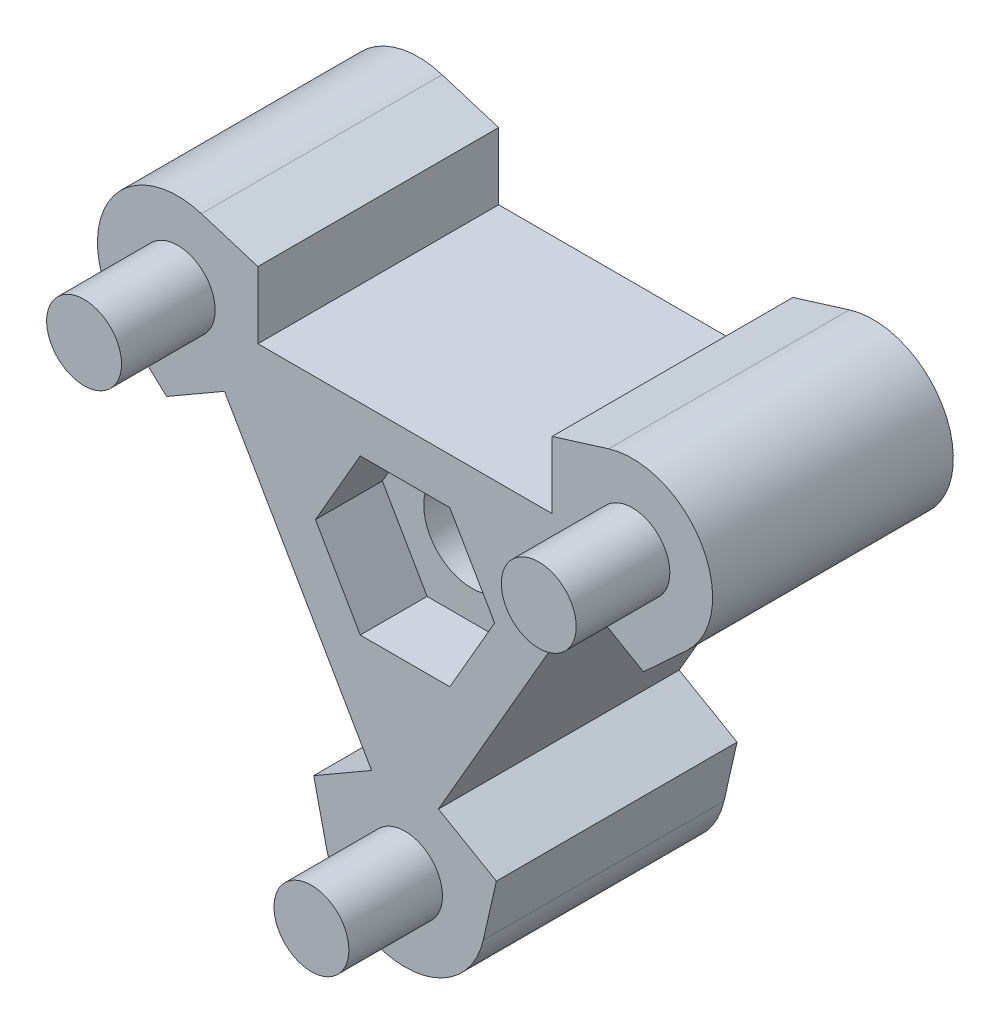
ISO-10303-21;
HEADER;
FILE_DESCRIPTION(('STEP AP214'),'2;1');
FILE_NAME('part.step','',(''),(''),'','','');
FILE_SCHEMA(('AUTOMOTIVE_DESIGN { 1 0 10303 214 1 1 1 1 }'));
ENDSEC;
DATA;
#1=APPLICATION_CONTEXT('core data for automotive mechanical design processes');
#2=APPLICATION_PROTOCOL_DEFINITION('international standard','automotive_design',2000,#1);
#3=PRODUCT_CONTEXT('',#1,'mechanical');
#4=PRODUCT('Part','Part','',(#3));
#5=PRODUCT_RELATED_PRODUCT_CATEGORY('part','',(#4));
#6=PRODUCT_DEFINITION_FORMATION('','',#4);
#7=PRODUCT_DEFINITION_CONTEXT('part definition',#1,'design');
#8=PRODUCT_DEFINITION('design','',#6,#7);
#9=PRODUCT_DEFINITION_SHAPE('','',#8);
#10=(LENGTH_UNIT() NAMED_UNIT(*) SI_UNIT(.MILLI.,.METRE.));
#11=(NAMED_UNIT(*) PLANE_ANGLE_UNIT() SI_UNIT($,.RADIAN.));
#12=(NAMED_UNIT(*) SI_UNIT($,.STERADIAN.) SOLID_ANGLE_UNIT());
#13=UNCERTAINTY_MEASURE_WITH_UNIT(LENGTH_MEASURE(1.E-05),#10,'distance_accuracy_value','');
#14=(GEOMETRIC_REPRESENTATION_CONTEXT(3) GLOBAL_UNCERTAINTY_ASSIGNED_CONTEXT((#13)) GLOBAL_UNIT_ASSIGNED_CONTEXT((#10,
#11,#12)) REPRESENTATION_CONTEXT('',''));
#15=CARTESIAN_POINT('',(0.,0.,0.));
#16=DIRECTION('',(0.,0.,1.));
#17=DIRECTION('',(1.,0.,0.));
#18=AXIS2_PLACEMENT_3D('',#15,#16,#17);
#19=CARTESIAN_POINT('',(2.74999999999996,4.76313972081436,4.));
#20=DIRECTION('',(0.499999999999998,0.86602540378444,0.));
#21=DIRECTION('',(-0.86602540378444,0.499999999999998,0.));
#22=AXIS2_PLACEMENT_3D('',#19,#20,#21);
#23=PLANE('',#22);
#24=DIRECTION('',(0.,0.,-1.));
#25=VECTOR('',#24,1.);
#26=CARTESIAN_POINT('',(6.74999999999994,2.45373864405588,4.));
#27=LINE('',#26,#25);
#28=CARTESIAN_POINT('',(6.74999999999994,2.45373864405588,4.));
#29=VERTEX_POINT('',#28);
#30=CARTESIAN_POINT('',(6.74999999999994,2.45373864405588,-5.));
#31=VERTEX_POINT('',#30);
#32=EDGE_CURVE('E218',#29,#31,#27,.T.);
#33=ORIENTED_EDGE('',*,*,#32,.T.);
#34=DIRECTION('',(-0.86602540378444,0.499999999999998,0.));
#35=VECTOR('',#34,1.);
#36=CARTESIAN_POINT('',(8.91506350946104,1.20373864405588,-5.));
#37=LINE('',#36,#35);
#38=CARTESIAN_POINT('',(8.91506350946104,1.20373864405588,-5.));
#39=VERTEX_POINT('',#38);
#40=EDGE_CURVE('E217',#39,#31,#37,.T.);
#41=ORIENTED_EDGE('',*,*,#40,.F.);
#42=DIRECTION('',(0.,0.,-1.));
#43=VECTOR('',#42,1.);
#44=CARTESIAN_POINT('',(8.91506350946104,1.20373864405588,4.));
#45=LINE('',#44,#43);
#46=CARTESIAN_POINT('',(8.91506350946104,1.20373864405588,4.));
#47=VERTEX_POINT('',#46);
#48=EDGE_CURVE('E11',#47,#39,#45,.T.);
#49=ORIENTED_EDGE('',*,*,#48,.F.);
#50=DIRECTION('',(0.86602540378444,-0.499999999999998,0.));
#51=VECTOR('',#50,1.);
#52=CARTESIAN_POINT('',(2.74999999999996,4.76313972081436,4.));
#53=LINE('',#52,#51);
#54=EDGE_CURVE('E382',#29,#47,#53,.T.);
#55=ORIENTED_EDGE('',*,*,#54,.F.);
#56=EDGE_LOOP('',(#33,#41,#49,#55));
#57=FACE_BOUND('',#56,.T.);
#58=ADVANCED_FACE('F45',(#57),#23,.F.);
#59=CARTESIAN_POINT('',(3.51368872105919,-3.79597064243409,4.));
#60=DIRECTION('',(-0.679293639164496,0.733866576286627,0.));
#61=DIRECTION('',(-0.733866576286627,-0.679293639164496,0.));
#62=AXIS2_PLACEMENT_3D('',#59,#60,#61);
#63=PLANE('',#62);
#64=ORIENTED_EDGE('',*,*,#48,.T.);
#65=DIRECTION('',(-0.733866576286624,-0.679293639164499,0.));
#66=VECTOR('',#65,1.);
#67=CARTESIAN_POINT('',(10.5378809174934,2.70587755925193,-5.));
#68=LINE('',#67,#66);
#69=CARTESIAN_POINT('',(10.5378809174934,2.70587755925193,-5.));
#70=VERTEX_POINT('',#69);
#71=EDGE_CURVE('E212',#70,#39,#68,.T.);
#72=ORIENTED_EDGE('',*,*,#71,.F.);
#73=DIRECTION('',(0.,0.,-1.));
#74=VECTOR('',#73,1.);
#75=CARTESIAN_POINT('',(10.5378809174934,2.70587755925192,4.));
#76=LINE('',#75,#74);
#77=CARTESIAN_POINT('',(10.5378809174934,2.70587755925192,4.));
#78=VERTEX_POINT('',#77);
#79=EDGE_CURVE('E54',#78,#70,#76,.T.);
#80=ORIENTED_EDGE('',*,*,#79,.F.);
#81=DIRECTION('',(0.733866576286627,0.679293639164496,0.));
#82=VECTOR('',#81,1.);
#83=CARTESIAN_POINT('',(3.51368872105919,-3.79597064243409,4.));
#84=LINE('',#83,#82);
#85=EDGE_CURVE('E213',#47,#78,#84,.T.);
#86=ORIENTED_EDGE('',*,*,#85,.F.);
#87=EDGE_LOOP('',(#64,#72,#80,#86));
#88=FACE_BOUND('',#87,.T.);
#89=ADVANCED_FACE('F209',(#88),#63,.F.);
#90=CARTESIAN_POINT('',(8.5,4.90747728811182,4.));
#91=DIRECTION('',(0.,0.,-1.));
#92=DIRECTION('',(-1.,0.,0.));
#93=AXIS2_PLACEMENT_3D('',#90,#91,#92);
#94=CYLINDRICAL_SURFACE('',#93,2.99999999999997);
#95=ORIENTED_EDGE('',*,*,#79,.T.);
#96=CARTESIAN_POINT('',(8.5,4.90747728811182,-5.));
#97=DIRECTION('',(0.,0.,-1.));
#98=DIRECTION('',(-1.,0.,0.));
#99=AXIS2_PLACEMENT_3D('',#96,#97,#98);
#100=CIRCLE('',#99,2.99999999999996);
#101=CARTESIAN_POINT('',(7.61229916458921,7.77313379697863,-5.));
#102=VERTEX_POINT('',#101);
#103=EDGE_CURVE('E230',#102,#70,#100,.T.);
#104=ORIENTED_EDGE('',*,*,#103,.F.);
#105=DIRECTION('',(0.,0.,-1.));
#106=VECTOR('',#105,1.);
#107=CARTESIAN_POINT('',(7.61229916458921,7.77313379697863,4.));
#108=LINE('',#107,#106);
#109=CARTESIAN_POINT('',(7.61229916458921,7.77313379697863,4.));
#110=VERTEX_POINT('',#109);
#111=EDGE_CURVE('E487',#110,#102,#108,.T.);
#112=ORIENTED_EDGE('',*,*,#111,.F.);
#113=CARTESIAN_POINT('',(8.5,4.90747728811182,4.));
#114=DIRECTION('',(0.,0.,1.));
#115=DIRECTION('',(1.,0.,0.));
#116=AXIS2_PLACEMENT_3D('',#113,#114,#115);
#117=CIRCLE('',#116,2.99999999999997);
#118=EDGE_CURVE('E390',#78,#110,#117,.T.);
#119=ORIENTED_EDGE('',*,*,#118,.F.);
#120=EDGE_LOOP('',(#95,#104,#112,#119));
#121=FACE_BOUND('',#120,.T.);
#122=ADVANCED_FACE('F493',(#121),#94,.T.);
#123=CARTESIAN_POINT('',(-1.53056264783827,4.9409290146451,4.));
#124=DIRECTION('',(-0.295900278470285,0.955218836288946,0.));
#125=DIRECTION('',(-0.955218836288946,-0.295900278470285,0.));
#126=AXIS2_PLACEMENT_3D('',#123,#124,#125);
#127=PLANE('',#126);
#128=ORIENTED_EDGE('',*,*,#111,.T.);
#129=DIRECTION('',(0.955218836288946,0.295900278470285,0.));
#130=VECTOR('',#129,1.);
#131=CARTESIAN_POINT('',(5.50000000000006,7.11880215351697,-5.));
#132=LINE('',#131,#130);
#133=CARTESIAN_POINT('',(5.50000000000006,7.11880215351697,-5.));
#134=VERTEX_POINT('',#133);
#135=EDGE_CURVE('E292',#134,#102,#132,.T.);
#136=ORIENTED_EDGE('',*,*,#135,.F.);
#137=DIRECTION('',(0.,0.,-1.));
#138=VECTOR('',#137,1.);
#139=CARTESIAN_POINT('',(5.50000000000006,7.11880215351697,4.));
#140=LINE('',#139,#138);
#141=CARTESIAN_POINT('',(5.50000000000006,7.11880215351697,4.));
#142=VERTEX_POINT('',#141);
#143=EDGE_CURVE('E484',#142,#134,#140,.T.);
#144=ORIENTED_EDGE('',*,*,#143,.F.);
#145=DIRECTION('',(0.955218836288946,0.295900278470285,0.));
#146=VECTOR('',#145,1.);
#147=CARTESIAN_POINT('',(-1.53056264783827,4.9409290146451,4.));
#148=LINE('',#147,#146);
#149=EDGE_CURVE('E393',#142,#110,#148,.T.);
#150=ORIENTED_EDGE('',*,*,#149,.T.);
#151=EDGE_LOOP('',(#128,#136,#144,#150));
#152=FACE_BOUND('',#151,.T.);
#153=ADVANCED_FACE('F572',(#152),#127,.T.);
#154=CARTESIAN_POINT('',(5.50000000000006,0.,4.));
#155=DIRECTION('',(-1.,0.,0.));
#156=DIRECTION('',(0.,-1.,0.));
#157=AXIS2_PLACEMENT_3D('',#154,#155,#156);
#158=PLANE('',#157);
#159=ORIENTED_EDGE('',*,*,#143,.T.);
#160=DIRECTION('',(0.,1.,0.));
#161=VECTOR('',#160,1.);
#162=CARTESIAN_POINT('',(5.50000000000006,4.61880215351697,-5.));
#163=LINE('',#162,#161);
#164=CARTESIAN_POINT('',(5.50000000000006,4.61880215351697,-5.));
#165=VERTEX_POINT('',#164);
#166=EDGE_CURVE('E288',#165,#134,#163,.T.);
#167=ORIENTED_EDGE('',*,*,#166,.F.);
#168=DIRECTION('',(0.,0.,-1.));
#169=VECTOR('',#168,1.);
#170=CARTESIAN_POINT('',(5.50000000000006,4.61880215351697,4.));
#171=LINE('',#170,#169);
#172=CARTESIAN_POINT('',(5.50000000000006,4.61880215351697,4.));
#173=VERTEX_POINT('',#172);
#174=EDGE_CURVE('E481',#173,#165,#171,.T.);
#175=ORIENTED_EDGE('',*,*,#174,.F.);
#176=DIRECTION('',(0.,1.,0.));
#177=VECTOR('',#176,1.);
#178=CARTESIAN_POINT('',(5.50000000000006,0.,4.));
#179=LINE('',#178,#177);
#180=EDGE_CURVE('E397',#173,#142,#179,.T.);
#181=ORIENTED_EDGE('',*,*,#180,.T.);
#182=EDGE_LOOP('',(#159,#167,#175,#181));
#183=FACE_BOUND('',#182,.T.);
#184=ADVANCED_FACE('F500',(#183),#158,.T.);
#185=CARTESIAN_POINT('',(0.,4.61880215351697,4.));
#186=DIRECTION('',(0.,-1.,0.));
#187=DIRECTION('',(1.,0.,0.));
#188=AXIS2_PLACEMENT_3D('',#185,#186,#187);
#189=PLANE('',#188);
#190=ORIENTED_EDGE('',*,*,#174,.T.);
#191=DIRECTION('',(1.,0.,0.));
#192=VECTOR('',#191,1.);
#193=CARTESIAN_POINT('',(-5.49999999999994,4.61880215351697,-5.));
#194=LINE('',#193,#192);
#195=CARTESIAN_POINT('',(-5.49999999999994,4.61880215351697,-5.));
#196=VERTEX_POINT('',#195);
#197=EDGE_CURVE('E284',#196,#165,#194,.T.);
#198=ORIENTED_EDGE('',*,*,#197,.F.);
#199=DIRECTION('',(0.,0.,-1.));
#200=VECTOR('',#199,1.);
#201=CARTESIAN_POINT('',(-5.49999999999994,4.61880215351697,4.));
#202=LINE('',#201,#200);
#203=CARTESIAN_POINT('',(-5.49999999999994,4.61880215351697,4.));
#204=VERTEX_POINT('',#203);
#205=EDGE_CURVE('E478',#204,#196,#202,.T.);
#206=ORIENTED_EDGE('',*,*,#205,.F.);
#207=DIRECTION('',(-1.,0.,0.));
#208=VECTOR('',#207,1.);
#209=CARTESIAN_POINT('',(0.,4.61880215351697,4.));
#210=LINE('',#209,#208);
#211=EDGE_CURVE('E401',#173,#204,#210,.T.);
#212=ORIENTED_EDGE('',*,*,#211,.F.);
#213=EDGE_LOOP('',(#190,#198,#206,#212));
#214=FACE_BOUND('',#213,.T.);
#215=ADVANCED_FACE('F506',(#214),#189,.F.);
#216=CARTESIAN_POINT('',(-5.49999999999993,0.,4.));
#217=DIRECTION('',(-1.,0.,0.));
#218=DIRECTION('',(0.,-1.,0.));
#219=AXIS2_PLACEMENT_3D('',#216,#217,#218);
#220=PLANE('',#219);
#221=ORIENTED_EDGE('',*,*,#205,.T.);
#222=DIRECTION('',(0.,-1.,0.));
#223=VECTOR('',#222,1.);
#224=CARTESIAN_POINT('',(-5.49999999999995,7.11880215351697,-5.));
#225=LINE('',#224,#223);
#226=CARTESIAN_POINT('',(-5.49999999999995,7.11880215351697,-5.));
#227=VERTEX_POINT('',#226);
#228=EDGE_CURVE('E280',#227,#196,#225,.T.);
#229=ORIENTED_EDGE('',*,*,#228,.F.);
#230=DIRECTION('',(0.,0.,-1.));
#231=VECTOR('',#230,1.);
#232=CARTESIAN_POINT('',(-5.49999999999995,7.11880215351697,4.));
#233=LINE('',#232,#231);
#234=CARTESIAN_POINT('',(-5.49999999999995,7.11880215351697,4.));
#235=VERTEX_POINT('',#234);
#236=EDGE_CURVE('E475',#235,#227,#233,.T.);
#237=ORIENTED_EDGE('',*,*,#236,.F.);
#238=DIRECTION('',(0.,1.,0.));
#239=VECTOR('',#238,1.);
#240=CARTESIAN_POINT('',(-5.49999999999993,0.,4.));
#241=LINE('',#240,#239);
#242=EDGE_CURVE('E404',#204,#235,#241,.T.);
#243=ORIENTED_EDGE('',*,*,#242,.F.);
#244=EDGE_LOOP('',(#221,#229,#237,#243));
#245=FACE_BOUND('',#244,.T.);
#246=ADVANCED_FACE('F513',(#245),#220,.F.);
#247=CARTESIAN_POINT('',(1.53056264783827,4.94092901464514,4.));
#248=DIRECTION('',(-0.295900278470283,-0.955218836288946,0.));
#249=DIRECTION('',(0.955218836288946,-0.295900278470283,0.));
#250=AXIS2_PLACEMENT_3D('',#247,#248,#249);
#251=PLANE('',#250);
#252=ORIENTED_EDGE('',*,*,#236,.T.);
#253=DIRECTION('',(0.955218836288954,-0.29590027847026,0.));
#254=VECTOR('',#253,1.);
#255=CARTESIAN_POINT('',(-7.61229916458913,7.77313379697858,-5.));
#256=LINE('',#255,#254);
#257=CARTESIAN_POINT('',(-7.61229916458913,7.77313379697855,-5.));
#258=VERTEX_POINT('',#257);
#259=EDGE_CURVE('E276',#258,#227,#256,.T.);
#260=ORIENTED_EDGE('',*,*,#259,.F.);
#261=DIRECTION('',(0.,0.,-1.));
#262=VECTOR('',#261,1.);
#263=CARTESIAN_POINT('',(-7.61229916458911,7.77313379697863,4.));
#264=LINE('',#263,#262);
#265=CARTESIAN_POINT('',(-7.61229916458911,7.77313379697863,4.));
#266=VERTEX_POINT('',#265);
#267=EDGE_CURVE('E472',#266,#258,#264,.T.);
#268=ORIENTED_EDGE('',*,*,#267,.F.);
#269=DIRECTION('',(-0.955218836288946,0.295900278470283,0.));
#270=VECTOR('',#269,1.);
#271=CARTESIAN_POINT('',(1.53056264783827,4.94092901464514,4.));
#272=LINE('',#271,#270);
#273=EDGE_CURVE('E407',#235,#266,#272,.T.);
#274=ORIENTED_EDGE('',*,*,#273,.F.);
#275=EDGE_LOOP('',(#252,#260,#268,#274));
#276=FACE_BOUND('',#275,.T.);
#277=ADVANCED_FACE('F516',(#276),#251,.F.);
#278=CARTESIAN_POINT('',(-8.50000000000001,4.90747728811182,4.));
#279=DIRECTION('',(0.,0.,-1.));
#280=DIRECTION('',(-1.,0.,0.));
#281=AXIS2_PLACEMENT_3D('',#278,#279,#280);
#282=CYLINDRICAL_SURFACE('',#281,2.99999999999993);
#283=ORIENTED_EDGE('',*,*,#267,.T.);
#284=CARTESIAN_POINT('',(-8.50000000000001,4.90747728811182,-5.));
#285=DIRECTION('',(0.,0.,-1.));
#286=DIRECTION('',(-1.,0.,0.));
#287=AXIS2_PLACEMENT_3D('',#284,#285,#286);
#288=CIRCLE('',#287,2.99999999999991);
#289=CARTESIAN_POINT('',(-10.5378809174935,2.7058775592521,-5.));
#290=VERTEX_POINT('',#289);
#291=EDGE_CURVE('E272',#290,#258,#288,.T.);
#292=ORIENTED_EDGE('',*,*,#291,.F.);
#293=DIRECTION('',(0.,0.,-1.));
#294=VECTOR('',#293,1.);
#295=CARTESIAN_POINT('',(-10.5378809174935,2.7058775592521,4.));
#296=LINE('',#295,#294);
#297=CARTESIAN_POINT('',(-10.5378809174935,2.7058775592521,4.));
#298=VERTEX_POINT('',#297);
#299=EDGE_CURVE('E469',#298,#290,#296,.T.);
#300=ORIENTED_EDGE('',*,*,#299,.F.);
#301=CARTESIAN_POINT('',(-8.50000000000001,4.90747728811182,4.));
#302=DIRECTION('',(0.,0.,1.));
#303=DIRECTION('',(1.,0.,0.));
#304=AXIS2_PLACEMENT_3D('',#301,#302,#303);
#305=CIRCLE('',#304,2.99999999999993);
#306=EDGE_CURVE('E410',#266,#298,#305,.T.);
#307=ORIENTED_EDGE('',*,*,#306,.F.);
#308=EDGE_LOOP('',(#283,#292,#300,#307));
#309=FACE_BOUND('',#308,.T.);
#310=ADVANCED_FACE('F521',(#309),#282,.T.);
#311=CARTESIAN_POINT('',(-3.5136887210591,-3.79597064243401,4.));
#312=DIRECTION('',(-0.679293639164494,-0.733866576286628,0.));
#313=DIRECTION('',(0.733866576286628,-0.679293639164494,0.));
#314=AXIS2_PLACEMENT_3D('',#311,#312,#313);
#315=PLANE('',#314);
#316=ORIENTED_EDGE('',*,*,#299,.T.);
#317=DIRECTION('',(-0.733866576286629,0.679293639164494,0.));
#318=VECTOR('',#317,1.);
#319=CARTESIAN_POINT('',(-8.9150635094611,1.20373864405608,-5.));
#320=LINE('',#319,#318);
#321=CARTESIAN_POINT('',(-8.9150635094611,1.20373864405608,-5.));
#322=VERTEX_POINT('',#321);
#323=EDGE_CURVE('E268',#322,#290,#320,.T.);
#324=ORIENTED_EDGE('',*,*,#323,.F.);
#325=DIRECTION('',(0.,0.,-1.));
#326=VECTOR('',#325,1.);
#327=CARTESIAN_POINT('',(-8.9150635094611,1.20373864405608,4.));
#328=LINE('',#327,#326);
#329=CARTESIAN_POINT('',(-8.9150635094611,1.20373864405608,4.));
#330=VERTEX_POINT('',#329);
#331=EDGE_CURVE('E466',#330,#322,#328,.T.);
#332=ORIENTED_EDGE('',*,*,#331,.F.);
#333=DIRECTION('',(-0.733866576286628,0.679293639164494,0.));
#334=VECTOR('',#333,1.);
#335=CARTESIAN_POINT('',(-3.5136887210591,-3.79597064243401,4.));
#336=LINE('',#335,#334);
#337=EDGE_CURVE('E413',#330,#298,#336,.T.);
#338=ORIENTED_EDGE('',*,*,#337,.T.);
#339=EDGE_LOOP('',(#316,#324,#332,#338));
#340=FACE_BOUND('',#339,.T.);
#341=ADVANCED_FACE('F587',(#340),#315,.T.);
#342=CARTESIAN_POINT('',(-2.75000000000007,4.76313972081454,4.));
#343=DIRECTION('',(0.499999999999999,-0.866025403784439,0.));
#344=DIRECTION('',(0.866025403784439,0.5,0.));
#345=AXIS2_PLACEMENT_3D('',#342,#343,#344);
#346=PLANE('',#345);
#347=ORIENTED_EDGE('',*,*,#331,.T.);
#348=DIRECTION('',(-0.866025403784439,-0.499999999999999,0.));
#349=VECTOR('',#348,1.);
#350=CARTESIAN_POINT('',(-6.75,2.45373864405608,-5.));
#351=LINE('',#350,#349);
#352=CARTESIAN_POINT('',(-6.75,2.45373864405608,-5.));
#353=VERTEX_POINT('',#352);
#354=EDGE_CURVE('E264',#353,#322,#351,.T.);
#355=ORIENTED_EDGE('',*,*,#354,.F.);
#356=DIRECTION('',(0.,0.,-1.));
#357=VECTOR('',#356,1.);
#358=CARTESIAN_POINT('',(-6.75,2.45373864405608,4.));
#359=LINE('',#358,#357);
#360=CARTESIAN_POINT('',(-6.75,2.45373864405608,4.));
#361=VERTEX_POINT('',#360);
#362=EDGE_CURVE('E463',#361,#353,#359,.T.);
#363=ORIENTED_EDGE('',*,*,#362,.F.);
#364=DIRECTION('',(-0.866025403784439,-0.5,0.));
#365=VECTOR('',#364,1.);
#366=CARTESIAN_POINT('',(-2.75000000000007,4.76313972081454,4.));
#367=LINE('',#366,#365);
#368=EDGE_CURVE('E417',#361,#330,#367,.T.);
#369=ORIENTED_EDGE('',*,*,#368,.T.);
#370=EDGE_LOOP('',(#347,#355,#363,#369));
#371=FACE_BOUND('',#370,.T.);
#372=ADVANCED_FACE('F526',(#371),#346,.T.);
#373=CARTESIAN_POINT('',(-3.99999999999993,-2.30940107675846,4.));
#374=DIRECTION('',(0.866025403784439,0.5,0.));
#375=DIRECTION('',(-0.5,0.866025403784439,0.));
#376=AXIS2_PLACEMENT_3D('',#373,#374,#375);
#377=PLANE('',#376);
#378=ORIENTED_EDGE('',*,*,#362,.T.);
#379=DIRECTION('',(-0.5,0.866025403784439,0.));
#380=VECTOR('',#379,1.);
#381=CARTESIAN_POINT('',(-1.25,-7.07254079757275,-5.));
#382=LINE('',#381,#380);
#383=CARTESIAN_POINT('',(-1.25,-7.07254079757275,-5.));
#384=VERTEX_POINT('',#383);
#385=EDGE_CURVE('E260',#384,#353,#382,.T.);
#386=ORIENTED_EDGE('',*,*,#385,.F.);
#387=DIRECTION('',(0.,0.,-1.));
#388=VECTOR('',#387,1.);
#389=CARTESIAN_POINT('',(-1.25,-7.07254079757275,4.));
#390=LINE('',#389,#388);
#391=CARTESIAN_POINT('',(-1.25,-7.07254079757275,4.));
#392=VERTEX_POINT('',#391);
#393=EDGE_CURVE('E460',#392,#384,#390,.T.);
#394=ORIENTED_EDGE('',*,*,#393,.F.);
#395=DIRECTION('',(0.5,-0.866025403784439,0.));
#396=VECTOR('',#395,1.);
#397=CARTESIAN_POINT('',(-3.99999999999993,-2.30940107675846,4.));
#398=LINE('',#397,#396);
#399=EDGE_CURVE('E421',#361,#392,#398,.T.);
#400=ORIENTED_EDGE('',*,*,#399,.F.);
#401=EDGE_LOOP('',(#378,#386,#394,#400));
#402=FACE_BOUND('',#401,.T.);
#403=ADVANCED_FACE('F532',(#402),#377,.F.);
#404=CARTESIAN_POINT('',(2.74999999999993,-4.76313972081429,4.));
#405=DIRECTION('',(0.5,-0.866025403784439,0.));
#406=DIRECTION('',(0.866025403784439,0.5,0.));
#407=AXIS2_PLACEMENT_3D('',#404,#405,#406);
#408=PLANE('',#407);
#409=ORIENTED_EDGE('',*,*,#393,.T.);
#410=DIRECTION('',(0.866025403784438,0.5,0.));
#411=VECTOR('',#410,1.);
#412=CARTESIAN_POINT('',(-3.4150635094611,-8.32254079757275,-5.));
#413=LINE('',#412,#411);
#414=CARTESIAN_POINT('',(-3.4150635094611,-8.32254079757275,-5.));
#415=VERTEX_POINT('',#414);
#416=EDGE_CURVE('E256',#415,#384,#413,.T.);
#417=ORIENTED_EDGE('',*,*,#416,.F.);
#418=DIRECTION('',(0.,0.,-1.));
#419=VECTOR('',#418,1.);
#420=CARTESIAN_POINT('',(-3.4150635094611,-8.32254079757275,4.));
#421=LINE('',#420,#419);
#422=CARTESIAN_POINT('',(-3.4150635094611,-8.32254079757275,4.));
#423=VERTEX_POINT('',#422);
#424=EDGE_CURVE('E457',#423,#415,#421,.T.);
#425=ORIENTED_EDGE('',*,*,#424,.F.);
#426=DIRECTION('',(-0.866025403784439,-0.5,0.));
#427=VECTOR('',#426,1.);
#428=CARTESIAN_POINT('',(2.74999999999993,-4.76313972081429,4.));
#429=LINE('',#428,#427);
#430=EDGE_CURVE('E424',#392,#423,#429,.T.);
#431=ORIENTED_EDGE('',*,*,#430,.F.);
#432=EDGE_LOOP('',(#409,#417,#425,#431));
#433=FACE_BOUND('',#432,.T.);
#434=ADVANCED_FACE('F539',(#433),#408,.F.);
#435=CARTESIAN_POINT('',(-5.04425136889737,-1.14495837221099,4.));
#436=DIRECTION('',(0.97519391763478,0.221352260002309,0.));
#437=DIRECTION('',(-0.221352260002309,0.97519391763478,0.));
#438=AXIS2_PLACEMENT_3D('',#435,#436,#437);
#439=PLANE('',#438);
#440=ORIENTED_EDGE('',*,*,#424,.T.);
#441=DIRECTION('',(-0.221352260002317,0.975193917634778,0.));
#442=VECTOR('',#441,1.);
#443=CARTESIAN_POINT('',(-2.92558175290431,-10.4790113562305,-5.));
#444=LINE('',#443,#442);
#445=CARTESIAN_POINT('',(-2.9255817529043,-10.4790113562305,-5.));
#446=VERTEX_POINT('',#445);
#447=EDGE_CURVE('E252',#446,#415,#444,.T.);
#448=ORIENTED_EDGE('',*,*,#447,.F.);
#449=DIRECTION('',(0.,0.,-1.));
#450=VECTOR('',#449,1.);
#451=CARTESIAN_POINT('',(-2.92558175290433,-10.4790113562305,4.));
#452=LINE('',#451,#450);
#453=CARTESIAN_POINT('',(-2.92558175290433,-10.4790113562305,4.));
#454=VERTEX_POINT('',#453);
#455=EDGE_CURVE('E454',#454,#446,#452,.T.);
#456=ORIENTED_EDGE('',*,*,#455,.F.);
#457=DIRECTION('',(0.221352260002309,-0.97519391763478,0.));
#458=VECTOR('',#457,1.);
#459=CARTESIAN_POINT('',(-5.04425136889737,-1.14495837221099,4.));
#460=LINE('',#459,#458);
#461=EDGE_CURVE('E427',#423,#454,#460,.T.);
#462=ORIENTED_EDGE('',*,*,#461,.F.);
#463=EDGE_LOOP('',(#440,#448,#456,#462));
#464=FACE_BOUND('',#463,.T.);
#465=ADVANCED_FACE('F542',(#464),#439,.F.);
#466=CARTESIAN_POINT('',(0.,-9.81495457622364,4.));
#467=DIRECTION('',(0.,0.,-1.));
#468=DIRECTION('',(-1.,0.,0.));
#469=AXIS2_PLACEMENT_3D('',#466,#467,#468);
#470=CYLINDRICAL_SURFACE('',#469,2.99999999999997);
#471=ORIENTED_EDGE('',*,*,#455,.T.);
#472=CARTESIAN_POINT('',(0.,-9.81495457622364,-5.));
#473=DIRECTION('',(0.,0.,-1.));
#474=DIRECTION('',(-1.,0.,0.));
#475=AXIS2_PLACEMENT_3D('',#472,#473,#474);
#476=CIRCLE('',#475,2.99999999999996);
#477=CARTESIAN_POINT('',(2.92558175290428,-10.4790113562306,-5.));
#478=VERTEX_POINT('',#477);
#479=EDGE_CURVE('E248',#478,#446,#476,.T.);
#480=ORIENTED_EDGE('',*,*,#479,.F.);
#481=DIRECTION('',(0.,0.,-1.));
#482=VECTOR('',#481,1.);
#483=CARTESIAN_POINT('',(2.92558175290428,-10.4790113562306,4.));
#484=LINE('',#483,#482);
#485=CARTESIAN_POINT('',(2.92558175290428,-10.4790113562306,4.));
#486=VERTEX_POINT('',#485);
#487=EDGE_CURVE('E451',#486,#478,#484,.T.);
#488=ORIENTED_EDGE('',*,*,#487,.F.);
#489=CARTESIAN_POINT('',(0.,-9.81495457622364,4.));
#490=DIRECTION('',(0.,0.,1.));
#491=DIRECTION('',(1.,0.,0.));
#492=AXIS2_PLACEMENT_3D('',#489,#490,#491);
#493=CIRCLE('',#492,2.99999999999997);
#494=EDGE_CURVE('E430',#454,#486,#493,.T.);
#495=ORIENTED_EDGE('',*,*,#494,.F.);
#496=EDGE_LOOP('',(#471,#480,#488,#495));
#497=FACE_BOUND('',#496,.T.);
#498=ADVANCED_FACE('F547',(#497),#470,.T.);
#499=CARTESIAN_POINT('',(5.04425136889741,-1.14495837221104,4.));
#500=DIRECTION('',(0.975193917634778,-0.221352260002317,0.));
#501=DIRECTION('',(0.221352260002317,0.975193917634778,0.));
#502=AXIS2_PLACEMENT_3D('',#499,#500,#501);
#503=PLANE('',#502);
#504=ORIENTED_EDGE('',*,*,#487,.T.);
#505=DIRECTION('',(-0.221352260002317,-0.975193917634778,0.));
#506=VECTOR('',#505,1.);
#507=CARTESIAN_POINT('',(3.41506350946104,-8.32254079757295,-5.));
#508=LINE('',#507,#506);
#509=CARTESIAN_POINT('',(3.41506350946104,-8.32254079757295,-5.));
#510=VERTEX_POINT('',#509);
#511=EDGE_CURVE('E244',#510,#478,#508,.T.);
#512=ORIENTED_EDGE('',*,*,#511,.F.);
#513=DIRECTION('',(0.,0.,-1.));
#514=VECTOR('',#513,1.);
#515=CARTESIAN_POINT('',(3.41506350946104,-8.32254079757295,4.));
#516=LINE('',#515,#514);
#517=CARTESIAN_POINT('',(3.41506350946104,-8.32254079757295,4.));
#518=VERTEX_POINT('',#517);
#519=EDGE_CURVE('E448',#518,#510,#516,.T.);
#520=ORIENTED_EDGE('',*,*,#519,.F.);
#521=DIRECTION('',(-0.221352260002317,-0.975193917634778,0.));
#522=VECTOR('',#521,1.);
#523=CARTESIAN_POINT('',(5.04425136889741,-1.14495837221104,4.));
#524=LINE('',#523,#522);
#525=EDGE_CURVE('E433',#518,#486,#524,.T.);
#526=ORIENTED_EDGE('',*,*,#525,.T.);
#527=EDGE_LOOP('',(#504,#512,#520,#526));
#528=FACE_BOUND('',#527,.T.);
#529=ADVANCED_FACE('F556',(#528),#503,.T.);
#530=CARTESIAN_POINT('',(-2.75000000000003,-4.76313972081447,4.));
#531=DIRECTION('',(0.5,0.866025403784439,0.));
#532=DIRECTION('',(-0.866025403784439,0.5,0.));
#533=AXIS2_PLACEMENT_3D('',#530,#531,#532);
#534=PLANE('',#533);
#535=ORIENTED_EDGE('',*,*,#519,.T.);
#536=DIRECTION('',(0.866025403784439,-0.5,0.));
#537=VECTOR('',#536,1.);
#538=CARTESIAN_POINT('',(1.24999999999994,-7.07254079757295,-5.));
#539=LINE('',#538,#537);
#540=CARTESIAN_POINT('',(1.24999999999994,-7.07254079757295,-5.));
#541=VERTEX_POINT('',#540);
#542=EDGE_CURVE('E240',#541,#510,#539,.T.);
#543=ORIENTED_EDGE('',*,*,#542,.F.);
#544=DIRECTION('',(0.,0.,-1.));
#545=VECTOR('',#544,1.);
#546=CARTESIAN_POINT('',(1.24999999999994,-7.07254079757295,4.));
#547=LINE('',#546,#545);
#548=CARTESIAN_POINT('',(1.24999999999994,-7.07254079757295,4.));
#549=VERTEX_POINT('',#548);
#550=EDGE_CURVE('E445',#549,#541,#547,.T.);
#551=ORIENTED_EDGE('',*,*,#550,.F.);
#552=DIRECTION('',(0.866025403784439,-0.5,0.));
#553=VECTOR('',#552,1.);
#554=CARTESIAN_POINT('',(-2.75000000000003,-4.76313972081447,4.));
#555=LINE('',#554,#553);
#556=EDGE_CURVE('E437',#549,#518,#555,.T.);
#557=ORIENTED_EDGE('',*,*,#556,.T.);
#558=EDGE_LOOP('',(#535,#543,#551,#557));
#559=FACE_BOUND('',#558,.T.);
#560=ADVANCED_FACE('F551',(#559),#534,.T.);
#561=CARTESIAN_POINT('',(3.99999999999997,-2.30940107675848,4.));
#562=DIRECTION('',(-0.866025403784439,0.5,0.));
#563=DIRECTION('',(-0.5,-0.866025403784439,0.));
#564=AXIS2_PLACEMENT_3D('',#561,#562,#563);
#565=PLANE('',#564);
#566=ORIENTED_EDGE('',*,*,#550,.T.);
#567=DIRECTION('',(-0.5,-0.866025403784439,0.));
#568=VECTOR('',#567,1.);
#569=CARTESIAN_POINT('',(6.74999999999994,2.45373864405588,-5.));
#570=LINE('',#569,#568);
#571=EDGE_CURVE('E223',#31,#541,#570,.T.);
#572=ORIENTED_EDGE('',*,*,#571,.F.);
#573=ORIENTED_EDGE('',*,*,#32,.F.);
#574=DIRECTION('',(0.5,0.866025403784439,0.));
#575=VECTOR('',#574,1.);
#576=CARTESIAN_POINT('',(3.99999999999997,-2.30940107675848,4.));
#577=LINE('',#576,#575);
#578=EDGE_CURVE('E69',#549,#29,#577,.T.);
#579=ORIENTED_EDGE('',*,*,#578,.F.);
#580=EDGE_LOOP('',(#566,#572,#573,#579));
#581=FACE_BOUND('',#580,.T.);
#582=ADVANCED_FACE('F554',(#581),#565,.F.);
#583=CARTESIAN_POINT('',(0.,0.,4.));
#584=DIRECTION('',(0.,0.,1.));
#585=DIRECTION('',(1.,0.,0.));
#586=AXIS2_PLACEMENT_3D('',#583,#584,#585);
#587=PLANE('',#586);
#588=DIRECTION('',(0.5,-0.866025403784439,0.));
#589=VECTOR('',#588,1.);
#590=CARTESIAN_POINT('',(-3.34863156129983,0.,4.));
#591=LINE('',#590,#589);
#592=CARTESIAN_POINT('',(-3.34863156129983,0.,4.));
#593=VERTEX_POINT('',#592);
#594=CARTESIAN_POINT('',(-1.67431578064991,-2.9,4.));
#595=VERTEX_POINT('',#594);
#596=EDGE_CURVE('E61',#593,#595,#591,.T.);
#597=ORIENTED_EDGE('',*,*,#596,.F.);
#598=DIRECTION('',(-0.5,-0.866025403784439,0.));
#599=VECTOR('',#598,1.);
#600=CARTESIAN_POINT('',(-1.67431578064991,2.9,4.));
#601=LINE('',#600,#599);
#602=CARTESIAN_POINT('',(-1.67431578064991,2.9,4.));
#603=VERTEX_POINT('',#602);
#604=EDGE_CURVE('E302',#603,#593,#601,.T.);
#605=ORIENTED_EDGE('',*,*,#604,.F.);
#606=DIRECTION('',(-1.,0.,0.));
#607=VECTOR('',#606,1.);
#608=CARTESIAN_POINT('',(1.67431578064991,2.9,4.));
#609=LINE('',#608,#607);
#610=CARTESIAN_POINT('',(1.67431578064991,2.9,4.));
#611=VERTEX_POINT('',#610);
#612=EDGE_CURVE('E337',#611,#603,#609,.T.);
#613=ORIENTED_EDGE('',*,*,#612,.F.);
#614=DIRECTION('',(-0.5,0.866025403784438,0.));
#615=VECTOR('',#614,1.);
#616=CARTESIAN_POINT('',(3.34863156129983,0.,4.));
#617=LINE('',#616,#615);
#618=CARTESIAN_POINT('',(3.34863156129983,0.,4.));
#619=VERTEX_POINT('',#618);
#620=EDGE_CURVE('E333',#619,#611,#617,.T.);
#621=ORIENTED_EDGE('',*,*,#620,.F.);
#622=DIRECTION('',(0.5,0.866025403784439,0.));
#623=VECTOR('',#622,1.);
#624=CARTESIAN_POINT('',(1.67431578064992,-2.9,4.));
#625=LINE('',#624,#623);
#626=CARTESIAN_POINT('',(1.67431578064992,-2.9,4.));
#627=VERTEX_POINT('',#626);
#628=EDGE_CURVE('E329',#627,#619,#625,.T.);
#629=ORIENTED_EDGE('',*,*,#628,.F.);
#630=DIRECTION('',(1.,0.,0.));
#631=VECTOR('',#630,1.);
#632=CARTESIAN_POINT('',(-1.67431578064991,-2.9,4.));
#633=LINE('',#632,#631);
#634=EDGE_CURVE('E325',#595,#627,#633,.T.);
#635=ORIENTED_EDGE('',*,*,#634,.F.);
#636=EDGE_LOOP('',(#597,#605,#613,#621,#629,#635));
#637=FACE_BOUND('',#636,.T.);
#638=CARTESIAN_POINT('',(8.5,4.90747728811182,4.));
#639=DIRECTION('',(0.,0.,1.));
#640=DIRECTION('',(1.,0.,0.));
#641=AXIS2_PLACEMENT_3D('',#638,#639,#640);
#642=CIRCLE('',#641,1.4);
#643=CARTESIAN_POINT('',(9.9,4.90747728811182,4.));
#644=VERTEX_POINT('',#643);
#645=EDGE_CURVE('E362',#644,#644,#642,.T.);
#646=ORIENTED_EDGE('',*,*,#645,.F.);
#647=EDGE_LOOP('',(#646));
#648=FACE_BOUND('',#647,.T.);
#649=CARTESIAN_POINT('',(0.,-9.81495457622364,4.));
#650=DIRECTION('',(0.,0.,1.));
#651=DIRECTION('',(1.,0.,0.));
#652=AXIS2_PLACEMENT_3D('',#649,#650,#651);
#653=CIRCLE('',#652,1.4);
#654=CARTESIAN_POINT('',(1.4,-9.81495457622364,4.));
#655=VERTEX_POINT('',#654);
#656=EDGE_CURVE('E370',#655,#655,#653,.T.);
#657=ORIENTED_EDGE('',*,*,#656,.F.);
#658=EDGE_LOOP('',(#657));
#659=FACE_BOUND('',#658,.T.);
#660=CARTESIAN_POINT('',(-8.50000000000001,4.90747728811182,4.));
#661=DIRECTION('',(0.,0.,1.));
#662=DIRECTION('',(1.,0.,0.));
#663=AXIS2_PLACEMENT_3D('',#660,#661,#662);
#664=CIRCLE('',#663,1.4);
#665=CARTESIAN_POINT('',(-7.10000000000001,4.90747728811182,4.));
#666=VERTEX_POINT('',#665);
#667=EDGE_CURVE('E374',#666,#666,#664,.T.);
#668=ORIENTED_EDGE('',*,*,#667,.F.);
#669=EDGE_LOOP('',(#668));
#670=FACE_BOUND('',#669,.T.);
#671=ORIENTED_EDGE('',*,*,#54,.T.);
#672=ORIENTED_EDGE('',*,*,#85,.T.);
#673=ORIENTED_EDGE('',*,*,#118,.T.);
#674=ORIENTED_EDGE('',*,*,#149,.F.);
#675=ORIENTED_EDGE('',*,*,#180,.F.);
#676=ORIENTED_EDGE('',*,*,#211,.T.);
#677=ORIENTED_EDGE('',*,*,#242,.T.);
#678=ORIENTED_EDGE('',*,*,#273,.T.);
#679=ORIENTED_EDGE('',*,*,#306,.T.);
#680=ORIENTED_EDGE('',*,*,#337,.F.);
#681=ORIENTED_EDGE('',*,*,#368,.F.);
#682=ORIENTED_EDGE('',*,*,#399,.T.);
#683=ORIENTED_EDGE('',*,*,#430,.T.);
#684=ORIENTED_EDGE('',*,*,#461,.T.);
#685=ORIENTED_EDGE('',*,*,#494,.T.);
#686=ORIENTED_EDGE('',*,*,#525,.F.);
#687=ORIENTED_EDGE('',*,*,#556,.F.);
#688=ORIENTED_EDGE('',*,*,#578,.T.);
#689=EDGE_LOOP('',(#671,#672,#673,#674,#675,#676,#677,#678,#679,#680,#681,#682,#683,#684,#685,
#686,#687,#688));
#690=FACE_BOUND('',#689,.T.);
#691=ADVANCED_FACE('F496',(#637,#648,#659,#670,#690),#587,.T.);
#692=CARTESIAN_POINT('',(-8.50000000000001,4.90747728811182,7.5));
#693=DIRECTION('',(0.,0.,-1.));
#694=DIRECTION('',(-1.,0.,0.));
#695=AXIS2_PLACEMENT_3D('',#692,#693,#694);
#696=CYLINDRICAL_SURFACE('',#695,1.4);
#697=CARTESIAN_POINT('',(-8.50000000000001,4.90747728811182,7.5));
#698=DIRECTION('',(0.,0.,1.));
#699=DIRECTION('',(1.,0.,0.));
#700=AXIS2_PLACEMENT_3D('',#697,#698,#699);
#701=CIRCLE('',#700,1.4);
#702=CARTESIAN_POINT('',(-7.10000000000001,4.90747728811182,7.5));
#703=VERTEX_POINT('',#702);
#704=EDGE_CURVE('E378',#703,#703,#701,.T.);
#705=ORIENTED_EDGE('',*,*,#704,.F.);
#706=EDGE_LOOP('',(#705));
#707=FACE_BOUND('',#706,.T.);
#708=ORIENTED_EDGE('',*,*,#667,.T.);
#709=EDGE_LOOP('',(#708));
#710=FACE_BOUND('',#709,.T.);
#711=ADVANCED_FACE('F633',(#707,#710),#696,.T.);
#712=CARTESIAN_POINT('',(-8.50000000000001,4.90747728811182,7.5));
#713=DIRECTION('',(0.,0.,1.));
#714=DIRECTION('',(1.,0.,0.));
#715=AXIS2_PLACEMENT_3D('',#712,#713,#714);
#716=PLANE('',#715);
#717=ORIENTED_EDGE('',*,*,#704,.T.);
#718=EDGE_LOOP('',(#717));
#719=FACE_BOUND('',#718,.T.);
#720=ADVANCED_FACE('F645',(#719),#716,.T.);
#721=CARTESIAN_POINT('',(0.,-9.81495457622364,7.5));
#722=DIRECTION('',(0.,0.,-1.));
#723=DIRECTION('',(-1.,0.,0.));
#724=AXIS2_PLACEMENT_3D('',#721,#722,#723);
#725=CYLINDRICAL_SURFACE('',#724,1.4);
#726=CARTESIAN_POINT('',(0.,-9.81495457622364,7.5));
#727=DIRECTION('',(0.,0.,1.));
#728=DIRECTION('',(1.,0.,0.));
#729=AXIS2_PLACEMENT_3D('',#726,#727,#728);
#730=CIRCLE('',#729,1.4);
#731=CARTESIAN_POINT('',(1.4,-9.81495457622364,7.5));
#732=VERTEX_POINT('',#731);
#733=EDGE_CURVE('E366',#732,#732,#730,.T.);
#734=ORIENTED_EDGE('',*,*,#733,.F.);
#735=EDGE_LOOP('',(#734));
#736=FACE_BOUND('',#735,.T.);
#737=ORIENTED_EDGE('',*,*,#656,.T.);
#738=EDGE_LOOP('',(#737));
#739=FACE_BOUND('',#738,.T.);
#740=ADVANCED_FACE('F655',(#736,#739),#725,.T.);
#741=CARTESIAN_POINT('',(0.,-9.81495457622364,7.5));
#742=DIRECTION('',(0.,0.,1.));
#743=DIRECTION('',(1.,0.,0.));
#744=AXIS2_PLACEMENT_3D('',#741,#742,#743);
#745=PLANE('',#744);
#746=ORIENTED_EDGE('',*,*,#733,.T.);
#747=EDGE_LOOP('',(#746));
#748=FACE_BOUND('',#747,.T.);
#749=ADVANCED_FACE('F665',(#748),#745,.T.);
#750=CARTESIAN_POINT('',(8.5,4.90747728811182,7.5));
#751=DIRECTION('',(0.,0.,-1.));
#752=DIRECTION('',(-1.,0.,0.));
#753=AXIS2_PLACEMENT_3D('',#750,#751,#752);
#754=CYLINDRICAL_SURFACE('',#753,1.4);
#755=CARTESIAN_POINT('',(8.5,4.90747728811182,7.5));
#756=DIRECTION('',(0.,0.,1.));
#757=DIRECTION('',(1.,0.,0.));
#758=AXIS2_PLACEMENT_3D('',#755,#756,#757);
#759=CIRCLE('',#758,1.4);
#760=CARTESIAN_POINT('',(9.9,4.90747728811182,7.5));
#761=VERTEX_POINT('',#760);
#762=EDGE_CURVE('E347',#761,#761,#759,.T.);
#763=ORIENTED_EDGE('',*,*,#762,.F.);
#764=EDGE_LOOP('',(#763));
#765=FACE_BOUND('',#764,.T.);
#766=ORIENTED_EDGE('',*,*,#645,.T.);
#767=EDGE_LOOP('',(#766));
#768=FACE_BOUND('',#767,.T.);
#769=ADVANCED_FACE('F675',(#765,#768),#754,.T.);
#770=CARTESIAN_POINT('',(8.5,4.90747728811182,7.5));
#771=DIRECTION('',(0.,0.,1.));
#772=DIRECTION('',(1.,0.,0.));
#773=AXIS2_PLACEMENT_3D('',#770,#771,#772);
#774=PLANE('',#773);
#775=ORIENTED_EDGE('',*,*,#762,.T.);
#776=EDGE_LOOP('',(#775));
#777=FACE_BOUND('',#776,.T.);
#778=ADVANCED_FACE('F685',(#777),#774,.T.);
#779=CARTESIAN_POINT('',(-3.34863156129983,0.,1.5));
#780=DIRECTION('',(-0.866025403784439,-0.5,0.));
#781=DIRECTION('',(0.5,-0.866025403784439,0.));
#782=AXIS2_PLACEMENT_3D('',#779,#780,#781);
#783=PLANE('',#782);
#784=ORIENTED_EDGE('',*,*,#596,.T.);
#785=DIRECTION('',(0.,0.,1.));
#786=VECTOR('',#785,1.);
#787=CARTESIAN_POINT('',(-1.67431578064991,-2.9,1.5));
#788=LINE('',#787,#786);
#789=CARTESIAN_POINT('',(-1.67431578064991,-2.9,1.5));
#790=VERTEX_POINT('',#789);
#791=EDGE_CURVE('E322',#790,#595,#788,.T.);
#792=ORIENTED_EDGE('',*,*,#791,.F.);
#793=DIRECTION('',(0.5,-0.866025403784439,0.));
#794=VECTOR('',#793,1.);
#795=CARTESIAN_POINT('',(-3.34863156129983,0.,1.5));
#796=LINE('',#795,#794);
#797=CARTESIAN_POINT('',(-3.34863156129983,0.,1.5));
#798=VERTEX_POINT('',#797);
#799=EDGE_CURVE('E297',#798,#790,#796,.T.);
#800=ORIENTED_EDGE('',*,*,#799,.F.);
#801=DIRECTION('',(0.,0.,1.));
#802=VECTOR('',#801,1.);
#803=CARTESIAN_POINT('',(-3.34863156129983,0.,1.5));
#804=LINE('',#803,#802);
#805=EDGE_CURVE('E344',#798,#593,#804,.T.);
#806=ORIENTED_EDGE('',*,*,#805,.T.);
#807=EDGE_LOOP('',(#784,#792,#800,#806));
#808=FACE_BOUND('',#807,.T.);
#809=ADVANCED_FACE('F694',(#808),#783,.F.);
#810=CARTESIAN_POINT('',(-1.67431578064991,2.9,1.5));
#811=DIRECTION('',(-0.866025403784439,0.5,0.));
#812=DIRECTION('',(-0.5,-0.866025403784439,0.));
#813=AXIS2_PLACEMENT_3D('',#810,#811,#812);
#814=PLANE('',#813);
#815=ORIENTED_EDGE('',*,*,#604,.T.);
#816=ORIENTED_EDGE('',*,*,#805,.F.);
#817=DIRECTION('',(-0.5,-0.866025403784439,0.));
#818=VECTOR('',#817,1.);
#819=CARTESIAN_POINT('',(-1.67431578064991,2.9,1.5));
#820=LINE('',#819,#818);
#821=CARTESIAN_POINT('',(-1.67431578064991,2.9,1.5));
#822=VERTEX_POINT('',#821);
#823=EDGE_CURVE('E318',#822,#798,#820,.T.);
#824=ORIENTED_EDGE('',*,*,#823,.F.);
#825=DIRECTION('',(0.,0.,1.));
#826=VECTOR('',#825,1.);
#827=CARTESIAN_POINT('',(-1.67431578064991,2.9,1.5));
#828=LINE('',#827,#826);
#829=EDGE_CURVE('E348',#822,#603,#828,.T.);
#830=ORIENTED_EDGE('',*,*,#829,.T.);
#831=EDGE_LOOP('',(#815,#816,#824,#830));
#832=FACE_BOUND('',#831,.T.);
#833=ADVANCED_FACE('F703',(#832),#814,.F.);
#834=CARTESIAN_POINT('',(1.67431578064991,2.9,1.5));
#835=DIRECTION('',(0.,1.,0.));
#836=DIRECTION('',(-1.,0.,0.));
#837=AXIS2_PLACEMENT_3D('',#834,#835,#836);
#838=PLANE('',#837);
#839=ORIENTED_EDGE('',*,*,#612,.T.);
#840=ORIENTED_EDGE('',*,*,#829,.F.);
#841=DIRECTION('',(-1.,0.,0.));
#842=VECTOR('',#841,1.);
#843=CARTESIAN_POINT('',(1.67431578064991,2.9,1.5));
#844=LINE('',#843,#842);
#845=CARTESIAN_POINT('',(1.67431578064991,2.9,1.5));
#846=VERTEX_POINT('',#845);
#847=EDGE_CURVE('E314',#846,#822,#844,.T.);
#848=ORIENTED_EDGE('',*,*,#847,.F.);
#849=DIRECTION('',(0.,0.,1.));
#850=VECTOR('',#849,1.);
#851=CARTESIAN_POINT('',(1.67431578064991,2.9,1.5));
#852=LINE('',#851,#850);
#853=EDGE_CURVE('E351',#846,#611,#852,.T.);
#854=ORIENTED_EDGE('',*,*,#853,.T.);
#855=EDGE_LOOP('',(#839,#840,#848,#854));
#856=FACE_BOUND('',#855,.T.);
#857=ADVANCED_FACE('F712',(#856),#838,.F.);
#858=CARTESIAN_POINT('',(3.34863156129983,0.,1.5));
#859=DIRECTION('',(0.866025403784438,0.5,0.));
#860=DIRECTION('',(-0.5,0.866025403784439,0.));
#861=AXIS2_PLACEMENT_3D('',#858,#859,#860);
#862=PLANE('',#861);
#863=ORIENTED_EDGE('',*,*,#620,.T.);
#864=ORIENTED_EDGE('',*,*,#853,.F.);
#865=DIRECTION('',(-0.5,0.866025403784438,0.));
#866=VECTOR('',#865,1.);
#867=CARTESIAN_POINT('',(3.34863156129983,0.,1.5));
#868=LINE('',#867,#866);
#869=CARTESIAN_POINT('',(3.34863156129983,0.,1.5));
#870=VERTEX_POINT('',#869);
#871=EDGE_CURVE('E310',#870,#846,#868,.T.);
#872=ORIENTED_EDGE('',*,*,#871,.F.);
#873=DIRECTION('',(0.,0.,1.));
#874=VECTOR('',#873,1.);
#875=CARTESIAN_POINT('',(3.34863156129983,0.,1.5));
#876=LINE('',#875,#874);
#877=EDGE_CURVE('E354',#870,#619,#876,.T.);
#878=ORIENTED_EDGE('',*,*,#877,.T.);
#879=EDGE_LOOP('',(#863,#864,#872,#878));
#880=FACE_BOUND('',#879,.T.);
#881=ADVANCED_FACE('F722',(#880),#862,.F.);
#882=CARTESIAN_POINT('',(1.67431578064992,-2.9,1.5));
#883=DIRECTION('',(0.866025403784439,-0.5,0.));
#884=DIRECTION('',(0.5,0.866025403784439,0.));
#885=AXIS2_PLACEMENT_3D('',#882,#883,#884);
#886=PLANE('',#885);
#887=ORIENTED_EDGE('',*,*,#628,.T.);
#888=ORIENTED_EDGE('',*,*,#877,.F.);
#889=DIRECTION('',(0.5,0.866025403784439,0.));
#890=VECTOR('',#889,1.);
#891=CARTESIAN_POINT('',(1.67431578064992,-2.9,1.5));
#892=LINE('',#891,#890);
#893=CARTESIAN_POINT('',(1.67431578064992,-2.9,1.5));
#894=VERTEX_POINT('',#893);
#895=EDGE_CURVE('E306',#894,#870,#892,.T.);
#896=ORIENTED_EDGE('',*,*,#895,.F.);
#897=DIRECTION('',(0.,0.,1.));
#898=VECTOR('',#897,1.);
#899=CARTESIAN_POINT('',(1.67431578064992,-2.9,1.5));
#900=LINE('',#899,#898);
#901=EDGE_CURVE('E357',#894,#627,#900,.T.);
#902=ORIENTED_EDGE('',*,*,#901,.T.);
#903=EDGE_LOOP('',(#887,#888,#896,#902));
#904=FACE_BOUND('',#903,.T.);
#905=ADVANCED_FACE('F732',(#904),#886,.F.);
#906=CARTESIAN_POINT('',(-1.67431578064991,-2.9,1.5));
#907=DIRECTION('',(0.,-1.,0.));
#908=DIRECTION('',(0.,0.,-1.));
#909=AXIS2_PLACEMENT_3D('',#906,#907,#908);
#910=PLANE('',#909);
#911=ORIENTED_EDGE('',*,*,#634,.T.);
#912=ORIENTED_EDGE('',*,*,#901,.F.);
#913=DIRECTION('',(1.,0.,0.));
#914=VECTOR('',#913,1.);
#915=CARTESIAN_POINT('',(-1.67431578064991,-2.9,1.5));
#916=LINE('',#915,#914);
#917=EDGE_CURVE('E301',#790,#894,#916,.T.);
#918=ORIENTED_EDGE('',*,*,#917,.F.);
#919=ORIENTED_EDGE('',*,*,#791,.T.);
#920=EDGE_LOOP('',(#911,#912,#918,#919));
#921=FACE_BOUND('',#920,.T.);
#922=ADVANCED_FACE('F742',(#921),#910,.F.);
#923=CARTESIAN_POINT('',(0.,0.,1.5));
#924=DIRECTION('',(0.,0.,1.));
#925=DIRECTION('',(1.,0.,0.));
#926=AXIS2_PLACEMENT_3D('',#923,#924,#925);
#927=PLANE('',#926);
#928=CARTESIAN_POINT('',(0.,0.,1.5));
#929=DIRECTION('',(0.,0.,1.));
#930=DIRECTION('',(1.,0.,0.));
#931=AXIS2_PLACEMENT_3D('',#928,#929,#930);
#932=CIRCLE('',#931,1.8);
#933=CARTESIAN_POINT('',(1.8,0.,1.5));
#934=VERTEX_POINT('',#933);
#935=EDGE_CURVE('E48',#934,#934,#932,.T.);
#936=ORIENTED_EDGE('',*,*,#935,.F.);
#937=EDGE_LOOP('',(#936));
#938=FACE_BOUND('',#937,.T.);
#939=ORIENTED_EDGE('',*,*,#799,.T.);
#940=ORIENTED_EDGE('',*,*,#917,.T.);
#941=ORIENTED_EDGE('',*,*,#895,.T.);
#942=ORIENTED_EDGE('',*,*,#871,.T.);
#943=ORIENTED_EDGE('',*,*,#847,.T.);
#944=ORIENTED_EDGE('',*,*,#823,.T.);
#945=EDGE_LOOP('',(#939,#940,#941,#942,#943,#944));
#946=FACE_BOUND('',#945,.T.);
#947=ADVANCED_FACE('F752',(#938,#946),#927,.T.);
#948=CARTESIAN_POINT('',(0.,0.,7.5));
#949=DIRECTION('',(0.,0.,-1.));
#950=DIRECTION('',(-1.,0.,0.));
#951=AXIS2_PLACEMENT_3D('',#948,#949,#950);
#952=CYLINDRICAL_SURFACE('',#951,1.8);
#953=ORIENTED_EDGE('',*,*,#935,.T.);
#954=EDGE_LOOP('',(#953));
#955=FACE_BOUND('',#954,.T.);
#956=CARTESIAN_POINT('',(0.,0.,-5.));
#957=DIRECTION('',(0.,0.,-1.));
#958=DIRECTION('',(-1.,0.,0.));
#959=AXIS2_PLACEMENT_3D('',#956,#957,#958);
#960=CIRCLE('',#959,1.8);
#961=CARTESIAN_POINT('',(-1.8,0.,-5.));
#962=VERTEX_POINT('',#961);
#963=EDGE_CURVE('E232',#962,#962,#960,.T.);
#964=ORIENTED_EDGE('',*,*,#963,.T.);
#965=EDGE_LOOP('',(#964));
#966=FACE_BOUND('',#965,.T.);
#967=ADVANCED_FACE('F762',(#955,#966),#952,.F.);
#968=CARTESIAN_POINT('',(0.,-9.81495457622364,-5.));
#969=DIRECTION('',(0.,0.,-1.));
#970=DIRECTION('',(-1.,0.,0.));
#971=AXIS2_PLACEMENT_3D('',#968,#969,#970);
#972=PLANE('',#971);
#973=ORIENTED_EDGE('',*,*,#71,.T.);
#974=ORIENTED_EDGE('',*,*,#40,.T.);
#975=ORIENTED_EDGE('',*,*,#571,.T.);
#976=ORIENTED_EDGE('',*,*,#542,.T.);
#977=ORIENTED_EDGE('',*,*,#511,.T.);
#978=ORIENTED_EDGE('',*,*,#479,.T.);
#979=ORIENTED_EDGE('',*,*,#447,.T.);
#980=ORIENTED_EDGE('',*,*,#416,.T.);
#981=ORIENTED_EDGE('',*,*,#385,.T.);
#982=ORIENTED_EDGE('',*,*,#354,.T.);
#983=ORIENTED_EDGE('',*,*,#323,.T.);
#984=ORIENTED_EDGE('',*,*,#291,.T.);
#985=ORIENTED_EDGE('',*,*,#259,.T.);
#986=ORIENTED_EDGE('',*,*,#228,.T.);
#987=ORIENTED_EDGE('',*,*,#197,.T.);
#988=ORIENTED_EDGE('',*,*,#166,.T.);
#989=ORIENTED_EDGE('',*,*,#135,.T.);
#990=ORIENTED_EDGE('',*,*,#103,.T.);
#991=EDGE_LOOP('',(#973,#974,#975,#976,#977,#978,#979,#980,#981,#982,#983,#984,#985,#986,#987,
#988,#989,#990));
#992=FACE_BOUND('',#991,.T.);
#993=ORIENTED_EDGE('',*,*,#963,.F.);
#994=EDGE_LOOP('',(#993));
#995=FACE_BOUND('',#994,.T.);
#996=ADVANCED_FACE('F226',(#992,#995),#972,.T.);
#997=CLOSED_SHELL('',(#58,#89,#122,#153,#184,#215,#246,#277,#310,#341,#372,#403,#434,#465,#498,
#529,#560,#582,#691,#711,#720,#740,#749,#769,#778,#809,#833,#857,#881,#905,#922,#947,#967,#996));
#998=MANIFOLD_SOLID_BREP('B2',#997);
#999=ADVANCED_BREP_SHAPE_REPRESENTATION('',(#18,#998),#14);
#1000=SHAPE_DEFINITION_REPRESENTATION(#9,#999);
ENDSEC;
END-ISO-10303-21;
